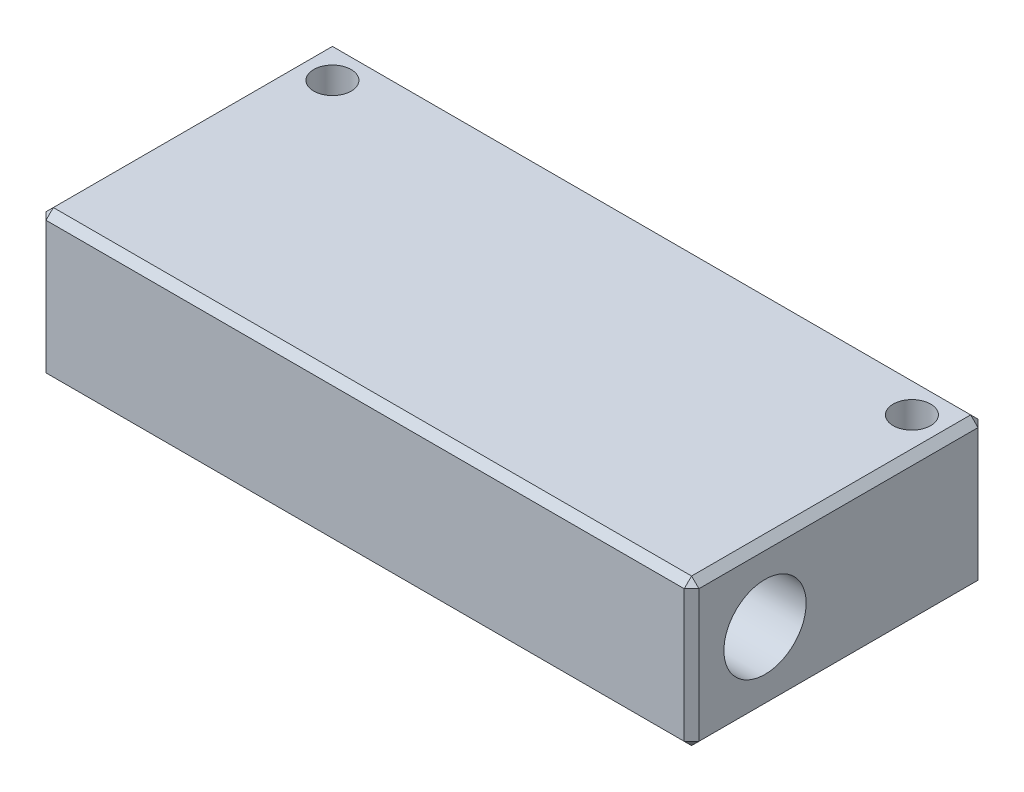
ISO-10303-21;
HEADER;
FILE_DESCRIPTION(('STEP AP214'),'2;1');
FILE_NAME('part.step','',(''),(''),'','','');
FILE_SCHEMA(('AUTOMOTIVE_DESIGN { 1 0 10303 214 1 1 1 1 }'));
ENDSEC;
DATA;
#1=APPLICATION_CONTEXT('core data for automotive mechanical design processes');
#2=APPLICATION_PROTOCOL_DEFINITION('international standard','automotive_design',2000,#1);
#3=PRODUCT_CONTEXT('',#1,'mechanical');
#4=PRODUCT('Part','Part','',(#3));
#5=PRODUCT_RELATED_PRODUCT_CATEGORY('part','',(#4));
#6=PRODUCT_DEFINITION_FORMATION('','',#4);
#7=PRODUCT_DEFINITION_CONTEXT('part definition',#1,'design');
#8=PRODUCT_DEFINITION('design','',#6,#7);
#9=PRODUCT_DEFINITION_SHAPE('','',#8);
#10=(LENGTH_UNIT() NAMED_UNIT(*) SI_UNIT(.MILLI.,.METRE.));
#11=(NAMED_UNIT(*) PLANE_ANGLE_UNIT() SI_UNIT($,.RADIAN.));
#12=(NAMED_UNIT(*) SI_UNIT($,.STERADIAN.) SOLID_ANGLE_UNIT());
#13=UNCERTAINTY_MEASURE_WITH_UNIT(LENGTH_MEASURE(1.E-05),#10,'distance_accuracy_value','');
#14=(GEOMETRIC_REPRESENTATION_CONTEXT(3) GLOBAL_UNCERTAINTY_ASSIGNED_CONTEXT((#13)) GLOBAL_UNIT_ASSIGNED_CONTEXT((#10,
#11,#12)) REPRESENTATION_CONTEXT('',''));
#15=CARTESIAN_POINT('',(0.,0.,0.));
#16=DIRECTION('',(0.,0.,1.));
#17=DIRECTION('',(1.,0.,0.));
#18=AXIS2_PLACEMENT_3D('',#15,#16,#17);
#19=CARTESIAN_POINT('',(-44.45,10.,9.99999999999999));
#20=DIRECTION('',(1.,0.,0.));
#21=DIRECTION('',(0.,0.,-1.));
#22=AXIS2_PLACEMENT_3D('',#19,#20,#21);
#23=CYLINDRICAL_SURFACE('',#22,5.);
#24=CARTESIAN_POINT('',(34.45,10.,9.99999999999999));
#25=DIRECTION('',(1.,0.,0.));
#26=DIRECTION('',(0.,0.,-1.));
#27=AXIS2_PLACEMENT_3D('',#24,#25,#26);
#28=CIRCLE('',#27,5.);
#29=CARTESIAN_POINT('',(34.45,10.,4.99999999999998));
#30=VERTEX_POINT('',#29);
#31=EDGE_CURVE('E159',#30,#30,#28,.F.);
#32=ORIENTED_EDGE('',*,*,#31,.F.);
#33=EDGE_LOOP('',(#32));
#34=FACE_BOUND('',#33,.T.);
#35=CARTESIAN_POINT('',(-34.45,10.,9.99999999999999));
#36=DIRECTION('',(-1.,0.,0.));
#37=DIRECTION('',(0.,0.,1.));
#38=AXIS2_PLACEMENT_3D('',#35,#36,#37);
#39=CIRCLE('',#38,5.);
#40=CARTESIAN_POINT('',(-34.45,10.,15.));
#41=VERTEX_POINT('',#40);
#42=EDGE_CURVE('E165',#41,#41,#39,.F.);
#43=ORIENTED_EDGE('',*,*,#42,.F.);
#44=EDGE_LOOP('',(#43));
#45=FACE_BOUND('',#44,.T.);
#46=ADVANCED_FACE('F35',(#34,#45),#23,.F.);
#47=CARTESIAN_POINT('',(44.45,20.,20.));
#48=DIRECTION('',(-1.,0.,0.));
#49=DIRECTION('',(0.,0.,1.));
#50=AXIS2_PLACEMENT_3D('',#47,#48,#49);
#51=PLANE('',#50);
#52=DIRECTION('',(0.,0.,1.));
#53=VECTOR('',#52,1.);
#54=CARTESIAN_POINT('',(44.45,19.,20.));
#55=LINE('',#54,#53);
#56=CARTESIAN_POINT('',(44.45,19.,-19.));
#57=VERTEX_POINT('',#56);
#58=CARTESIAN_POINT('',(44.45,19.,19.));
#59=VERTEX_POINT('',#58);
#60=EDGE_CURVE('E185',#57,#59,#55,.T.);
#61=ORIENTED_EDGE('',*,*,#60,.T.);
#62=DIRECTION('',(0.,-1.,0.));
#63=VECTOR('',#62,1.);
#64=CARTESIAN_POINT('',(44.45,20.,19.));
#65=LINE('',#64,#63);
#66=CARTESIAN_POINT('',(44.45,1.00000000000001,19.));
#67=VERTEX_POINT('',#66);
#68=EDGE_CURVE('E191',#59,#67,#65,.T.);
#69=ORIENTED_EDGE('',*,*,#68,.T.);
#70=DIRECTION('',(0.,0.,-1.));
#71=VECTOR('',#70,1.);
#72=CARTESIAN_POINT('',(44.45,1.00000000000001,-20.));
#73=LINE('',#72,#71);
#74=CARTESIAN_POINT('',(44.45,1.00000000000001,-19.));
#75=VERTEX_POINT('',#74);
#76=EDGE_CURVE('E189',#67,#75,#73,.T.);
#77=ORIENTED_EDGE('',*,*,#76,.T.);
#78=DIRECTION('',(0.,1.,0.));
#79=VECTOR('',#78,1.);
#80=CARTESIAN_POINT('',(44.45,20.,-19.));
#81=LINE('',#80,#79);
#82=EDGE_CURVE('E187',#75,#57,#81,.T.);
#83=ORIENTED_EDGE('',*,*,#82,.T.);
#84=EDGE_LOOP('',(#61,#69,#77,#83));
#85=FACE_BOUND('',#84,.T.);
#86=CARTESIAN_POINT('',(44.45,10.,9.99999999999999));
#87=DIRECTION('',(1.,0.,0.));
#88=DIRECTION('',(0.,0.,-1.));
#89=AXIS2_PLACEMENT_3D('',#86,#87,#88);
#90=CIRCLE('',#89,5.6);
#91=CARTESIAN_POINT('',(44.45,10.,4.39999999999999));
#92=VERTEX_POINT('',#91);
#93=EDGE_CURVE('E300',#92,#92,#90,.T.);
#94=ORIENTED_EDGE('',*,*,#93,.F.);
#95=EDGE_LOOP('',(#94));
#96=FACE_BOUND('',#95,.T.);
#97=ADVANCED_FACE('F310',(#85,#96),#51,.F.);
#98=CARTESIAN_POINT('',(-44.45,20.,-20.));
#99=DIRECTION('',(0.,0.,1.));
#100=DIRECTION('',(1.,0.,0.));
#101=AXIS2_PLACEMENT_3D('',#98,#99,#100);
#102=PLANE('',#101);
#103=DIRECTION('',(-1.,0.,0.));
#104=VECTOR('',#103,1.);
#105=CARTESIAN_POINT('',(-44.45,1.00000000000003,-20.));
#106=LINE('',#105,#104);
#107=CARTESIAN_POINT('',(43.45,1.00000000000003,-20.));
#108=VERTEX_POINT('',#107);
#109=CARTESIAN_POINT('',(-43.45,1.00000000000003,-20.));
#110=VERTEX_POINT('',#109);
#111=EDGE_CURVE('E173',#108,#110,#106,.T.);
#112=ORIENTED_EDGE('',*,*,#111,.T.);
#113=DIRECTION('',(0.,1.,0.));
#114=VECTOR('',#113,1.);
#115=CARTESIAN_POINT('',(-43.45,20.,-20.));
#116=LINE('',#115,#114);
#117=CARTESIAN_POINT('',(-43.45,19.,-20.));
#118=VERTEX_POINT('',#117);
#119=EDGE_CURVE('E175',#110,#118,#116,.T.);
#120=ORIENTED_EDGE('',*,*,#119,.T.);
#121=DIRECTION('',(1.,0.,0.));
#122=VECTOR('',#121,1.);
#123=CARTESIAN_POINT('',(-44.45,19.,-20.));
#124=LINE('',#123,#122);
#125=CARTESIAN_POINT('',(43.45,19.,-20.));
#126=VERTEX_POINT('',#125);
#127=EDGE_CURVE('E169',#118,#126,#124,.T.);
#128=ORIENTED_EDGE('',*,*,#127,.T.);
#129=DIRECTION('',(0.,-1.,0.));
#130=VECTOR('',#129,1.);
#131=CARTESIAN_POINT('',(43.45,20.,-20.));
#132=LINE('',#131,#130);
#133=EDGE_CURVE('E171',#126,#108,#132,.T.);
#134=ORIENTED_EDGE('',*,*,#133,.T.);
#135=EDGE_LOOP('',(#112,#120,#128,#134));
#136=FACE_BOUND('',#135,.T.);
#137=CARTESIAN_POINT('',(-22.5,10.,-20.));
#138=DIRECTION('',(0.,0.,-1.));
#139=DIRECTION('',(-1.,0.,0.));
#140=AXIS2_PLACEMENT_3D('',#137,#138,#139);
#141=CIRCLE('',#140,4.);
#142=CARTESIAN_POINT('',(-26.5,10.,-20.));
#143=VERTEX_POINT('',#142);
#144=EDGE_CURVE('E280',#143,#143,#141,.T.);
#145=ORIENTED_EDGE('',*,*,#144,.F.);
#146=EDGE_LOOP('',(#145));
#147=FACE_BOUND('',#146,.T.);
#148=CARTESIAN_POINT('',(22.5,10.,-20.));
#149=DIRECTION('',(0.,0.,-1.));
#150=DIRECTION('',(-1.,0.,0.));
#151=AXIS2_PLACEMENT_3D('',#148,#149,#150);
#152=CIRCLE('',#151,4.);
#153=CARTESIAN_POINT('',(18.5,10.,-20.));
#154=VERTEX_POINT('',#153);
#155=EDGE_CURVE('E284',#154,#154,#152,.T.);
#156=ORIENTED_EDGE('',*,*,#155,.F.);
#157=EDGE_LOOP('',(#156));
#158=FACE_BOUND('',#157,.T.);
#159=ADVANCED_FACE('F316',(#136,#147,#158),#102,.F.);
#160=CARTESIAN_POINT('',(-44.45,20.,20.));
#161=DIRECTION('',(1.,0.,0.));
#162=DIRECTION('',(0.,0.,-1.));
#163=AXIS2_PLACEMENT_3D('',#160,#161,#162);
#164=PLANE('',#163);
#165=DIRECTION('',(0.,-1.,0.));
#166=VECTOR('',#165,1.);
#167=CARTESIAN_POINT('',(-44.45,20.,-19.));
#168=LINE('',#167,#166);
#169=CARTESIAN_POINT('',(-44.45,19.,-19.));
#170=VERTEX_POINT('',#169);
#171=CARTESIAN_POINT('',(-44.45,1.00000000000001,-19.));
#172=VERTEX_POINT('',#171);
#173=EDGE_CURVE('E138',#170,#172,#168,.T.);
#174=ORIENTED_EDGE('',*,*,#173,.T.);
#175=DIRECTION('',(0.,0.,1.));
#176=VECTOR('',#175,1.);
#177=CARTESIAN_POINT('',(-44.45,1.00000000000001,20.));
#178=LINE('',#177,#176);
#179=CARTESIAN_POINT('',(-44.45,1.00000000000001,19.));
#180=VERTEX_POINT('',#179);
#181=EDGE_CURVE('E134',#172,#180,#178,.T.);
#182=ORIENTED_EDGE('',*,*,#181,.T.);
#183=DIRECTION('',(0.,1.,0.));
#184=VECTOR('',#183,1.);
#185=CARTESIAN_POINT('',(-44.45,20.,19.));
#186=LINE('',#185,#184);
#187=CARTESIAN_POINT('',(-44.45,19.,19.));
#188=VERTEX_POINT('',#187);
#189=EDGE_CURVE('E126',#180,#188,#186,.T.);
#190=ORIENTED_EDGE('',*,*,#189,.T.);
#191=DIRECTION('',(0.,0.,-1.));
#192=VECTOR('',#191,1.);
#193=CARTESIAN_POINT('',(-44.45,19.,20.));
#194=LINE('',#193,#192);
#195=EDGE_CURVE('E131',#188,#170,#194,.T.);
#196=ORIENTED_EDGE('',*,*,#195,.T.);
#197=EDGE_LOOP('',(#174,#182,#190,#196));
#198=FACE_BOUND('',#197,.T.);
#199=CARTESIAN_POINT('',(-44.45,10.,9.99999999999999));
#200=DIRECTION('',(1.,0.,0.));
#201=DIRECTION('',(0.,0.,-1.));
#202=AXIS2_PLACEMENT_3D('',#199,#200,#201);
#203=CIRCLE('',#202,5.6);
#204=CARTESIAN_POINT('',(-44.45,10.,4.39999999999999));
#205=VERTEX_POINT('',#204);
#206=EDGE_CURVE('E290',#205,#205,#203,.T.);
#207=ORIENTED_EDGE('',*,*,#206,.T.);
#208=EDGE_LOOP('',(#207));
#209=FACE_BOUND('',#208,.T.);
#210=ADVANCED_FACE('F129',(#198,#209),#164,.F.);
#211=CARTESIAN_POINT('',(-44.45,20.,20.));
#212=DIRECTION('',(0.,0.,-1.));
#213=DIRECTION('',(-1.,0.,0.));
#214=AXIS2_PLACEMENT_3D('',#211,#212,#213);
#215=PLANE('',#214);
#216=DIRECTION('',(0.,-1.,0.));
#217=VECTOR('',#216,1.);
#218=CARTESIAN_POINT('',(-43.45,20.,20.));
#219=LINE('',#218,#217);
#220=CARTESIAN_POINT('',(-43.45,19.,20.));
#221=VERTEX_POINT('',#220);
#222=CARTESIAN_POINT('',(-43.45,1.00000000000001,20.));
#223=VERTEX_POINT('',#222);
#224=EDGE_CURVE('E145',#221,#223,#219,.T.);
#225=ORIENTED_EDGE('',*,*,#224,.T.);
#226=DIRECTION('',(1.,0.,0.));
#227=VECTOR('',#226,1.);
#228=CARTESIAN_POINT('',(44.45,1.00000000000001,20.));
#229=LINE('',#228,#227);
#230=CARTESIAN_POINT('',(43.45,1.00000000000001,20.));
#231=VERTEX_POINT('',#230);
#232=EDGE_CURVE('E183',#223,#231,#229,.T.);
#233=ORIENTED_EDGE('',*,*,#232,.T.);
#234=DIRECTION('',(0.,1.,0.));
#235=VECTOR('',#234,1.);
#236=CARTESIAN_POINT('',(43.45,20.,20.));
#237=LINE('',#236,#235);
#238=CARTESIAN_POINT('',(43.45,19.,20.));
#239=VERTEX_POINT('',#238);
#240=EDGE_CURVE('E180',#231,#239,#237,.T.);
#241=ORIENTED_EDGE('',*,*,#240,.T.);
#242=DIRECTION('',(-1.,0.,0.));
#243=VECTOR('',#242,1.);
#244=CARTESIAN_POINT('',(-44.45,19.,20.));
#245=LINE('',#244,#243);
#246=EDGE_CURVE('E178',#239,#221,#245,.T.);
#247=ORIENTED_EDGE('',*,*,#246,.T.);
#248=EDGE_LOOP('',(#225,#233,#241,#247));
#249=FACE_BOUND('',#248,.T.);
#250=ADVANCED_FACE('F328',(#249),#215,.F.);
#251=CARTESIAN_POINT('',(0.,20.,0.));
#252=DIRECTION('',(0.,-1.,0.));
#253=DIRECTION('',(0.,0.,-1.));
#254=AXIS2_PLACEMENT_3D('',#251,#252,#253);
#255=PLANE('',#254);
#256=DIRECTION('',(-1.,0.,0.));
#257=VECTOR('',#256,1.);
#258=CARTESIAN_POINT('',(0.,20.,-19.));
#259=LINE('',#258,#257);
#260=CARTESIAN_POINT('',(43.45,20.,-19.));
#261=VERTEX_POINT('',#260);
#262=CARTESIAN_POINT('',(-43.45,20.,-19.));
#263=VERTEX_POINT('',#262);
#264=EDGE_CURVE('E203',#261,#263,#259,.T.);
#265=ORIENTED_EDGE('',*,*,#264,.T.);
#266=DIRECTION('',(0.,0.,1.));
#267=VECTOR('',#266,1.);
#268=CARTESIAN_POINT('',(-43.45,20.,0.));
#269=LINE('',#268,#267);
#270=CARTESIAN_POINT('',(-43.45,20.,19.));
#271=VERTEX_POINT('',#270);
#272=EDGE_CURVE('E11',#263,#271,#269,.T.);
#273=ORIENTED_EDGE('',*,*,#272,.T.);
#274=DIRECTION('',(1.,0.,0.));
#275=VECTOR('',#274,1.);
#276=CARTESIAN_POINT('',(0.,20.,19.));
#277=LINE('',#276,#275);
#278=CARTESIAN_POINT('',(43.45,20.,19.));
#279=VERTEX_POINT('',#278);
#280=EDGE_CURVE('E44',#271,#279,#277,.T.);
#281=ORIENTED_EDGE('',*,*,#280,.T.);
#282=DIRECTION('',(0.,0.,-1.));
#283=VECTOR('',#282,1.);
#284=CARTESIAN_POINT('',(43.45,20.,0.));
#285=LINE('',#284,#283);
#286=EDGE_CURVE('E205',#279,#261,#285,.T.);
#287=ORIENTED_EDGE('',*,*,#286,.T.);
#288=EDGE_LOOP('',(#265,#273,#281,#287));
#289=FACE_BOUND('',#288,.T.);
#290=CARTESIAN_POINT('',(39.45,20.,-15.));
#291=DIRECTION('',(0.,1.,0.));
#292=DIRECTION('',(0.,0.,1.));
#293=AXIS2_PLACEMENT_3D('',#290,#291,#292);
#294=CIRCLE('',#293,2.55269999999998);
#295=CARTESIAN_POINT('',(39.45,20.,-12.4473));
#296=VERTEX_POINT('',#295);
#297=EDGE_CURVE('E261',#296,#296,#294,.T.);
#298=ORIENTED_EDGE('',*,*,#297,.F.);
#299=EDGE_LOOP('',(#298));
#300=FACE_BOUND('',#299,.T.);
#301=CARTESIAN_POINT('',(-39.45,20.,-15.));
#302=DIRECTION('',(0.,1.,0.));
#303=DIRECTION('',(0.,0.,1.));
#304=AXIS2_PLACEMENT_3D('',#301,#302,#303);
#305=CIRCLE('',#304,2.55269999999999);
#306=CARTESIAN_POINT('',(-39.45,20.,-12.4473));
#307=VERTEX_POINT('',#306);
#308=EDGE_CURVE('E272',#307,#307,#305,.T.);
#309=ORIENTED_EDGE('',*,*,#308,.F.);
#310=EDGE_LOOP('',(#309));
#311=FACE_BOUND('',#310,.T.);
#312=ADVANCED_FACE('F324',(#289,#300,#311),#255,.F.);
#313=CARTESIAN_POINT('',(0.,0.,0.));
#314=DIRECTION('',(0.,-1.,0.));
#315=DIRECTION('',(0.,0.,-1.));
#316=AXIS2_PLACEMENT_3D('',#313,#314,#315);
#317=PLANE('',#316);
#318=DIRECTION('',(0.,0.,-1.));
#319=VECTOR('',#318,1.);
#320=CARTESIAN_POINT('',(-43.45,0.,-20.));
#321=LINE('',#320,#319);
#322=CARTESIAN_POINT('',(-43.45,0.,19.));
#323=VERTEX_POINT('',#322);
#324=CARTESIAN_POINT('',(-43.45,0.,-19.));
#325=VERTEX_POINT('',#324);
#326=EDGE_CURVE('E198',#323,#325,#321,.T.);
#327=ORIENTED_EDGE('',*,*,#326,.T.);
#328=DIRECTION('',(1.,0.,0.));
#329=VECTOR('',#328,1.);
#330=CARTESIAN_POINT('',(44.45,0.,-19.));
#331=LINE('',#330,#329);
#332=CARTESIAN_POINT('',(43.45,0.,-19.));
#333=VERTEX_POINT('',#332);
#334=EDGE_CURVE('E200',#325,#333,#331,.T.);
#335=ORIENTED_EDGE('',*,*,#334,.T.);
#336=DIRECTION('',(0.,0.,1.));
#337=VECTOR('',#336,1.);
#338=CARTESIAN_POINT('',(43.45,0.,20.));
#339=LINE('',#338,#337);
#340=CARTESIAN_POINT('',(43.45,0.,19.));
#341=VERTEX_POINT('',#340);
#342=EDGE_CURVE('E194',#333,#341,#339,.T.);
#343=ORIENTED_EDGE('',*,*,#342,.T.);
#344=DIRECTION('',(-1.,0.,0.));
#345=VECTOR('',#344,1.);
#346=CARTESIAN_POINT('',(-44.45,0.,19.));
#347=LINE('',#346,#345);
#348=EDGE_CURVE('E196',#341,#323,#347,.T.);
#349=ORIENTED_EDGE('',*,*,#348,.T.);
#350=EDGE_LOOP('',(#327,#335,#343,#349));
#351=FACE_BOUND('',#350,.T.);
#352=CARTESIAN_POINT('',(39.45,0.,-15.));
#353=DIRECTION('',(0.,1.,0.));
#354=DIRECTION('',(0.,0.,1.));
#355=AXIS2_PLACEMENT_3D('',#352,#353,#354);
#356=CIRCLE('',#355,2.5527);
#357=CARTESIAN_POINT('',(39.45,0.,-12.4473));
#358=VERTEX_POINT('',#357);
#359=EDGE_CURVE('E267',#358,#358,#356,.T.);
#360=ORIENTED_EDGE('',*,*,#359,.T.);
#361=EDGE_LOOP('',(#360));
#362=FACE_BOUND('',#361,.T.);
#363=CARTESIAN_POINT('',(-39.45,0.,-15.));
#364=DIRECTION('',(0.,1.,0.));
#365=DIRECTION('',(0.,0.,1.));
#366=AXIS2_PLACEMENT_3D('',#363,#364,#365);
#367=CIRCLE('',#366,2.5527);
#368=CARTESIAN_POINT('',(-39.45,0.,-12.4473));
#369=VERTEX_POINT('',#368);
#370=EDGE_CURVE('E277',#369,#369,#367,.T.);
#371=ORIENTED_EDGE('',*,*,#370,.T.);
#372=EDGE_LOOP('',(#371));
#373=FACE_BOUND('',#372,.T.);
#374=ADVANCED_FACE('F327',(#351,#362,#373),#317,.T.);
#375=CARTESIAN_POINT('',(34.45,10.,9.99999999999999));
#376=DIRECTION('',(1.,0.,0.));
#377=DIRECTION('',(0.,0.,-1.));
#378=AXIS2_PLACEMENT_3D('',#375,#376,#377);
#379=PLANE('',#378);
#380=CARTESIAN_POINT('',(34.45,10.,9.99999999999999));
#381=DIRECTION('',(1.,0.,0.));
#382=DIRECTION('',(0.,0.,-1.));
#383=AXIS2_PLACEMENT_3D('',#380,#381,#382);
#384=CIRCLE('',#383,5.6);
#385=CARTESIAN_POINT('',(34.45,10.,4.39999999999999));
#386=VERTEX_POINT('',#385);
#387=EDGE_CURVE('E162',#386,#386,#384,.T.);
#388=ORIENTED_EDGE('',*,*,#387,.T.);
#389=EDGE_LOOP('',(#388));
#390=FACE_BOUND('',#389,.T.);
#391=ORIENTED_EDGE('',*,*,#31,.T.);
#392=EDGE_LOOP('',(#391));
#393=FACE_BOUND('',#392,.T.);
#394=ADVANCED_FACE('F331',(#390,#393),#379,.T.);
#395=CARTESIAN_POINT('',(34.45,10.,9.99999999999999));
#396=DIRECTION('',(1.,0.,0.));
#397=DIRECTION('',(0.,0.,-1.));
#398=AXIS2_PLACEMENT_3D('',#395,#396,#397);
#399=CYLINDRICAL_SURFACE('',#398,5.6);
#400=ORIENTED_EDGE('',*,*,#387,.F.);
#401=EDGE_LOOP('',(#400));
#402=FACE_BOUND('',#401,.T.);
#403=ORIENTED_EDGE('',*,*,#93,.T.);
#404=EDGE_LOOP('',(#403));
#405=FACE_BOUND('',#404,.T.);
#406=ADVANCED_FACE('F322',(#402,#405),#399,.F.);
#407=CARTESIAN_POINT('',(-34.45,10.,9.99999999999999));
#408=DIRECTION('',(-1.,0.,0.));
#409=DIRECTION('',(0.,0.,-1.));
#410=AXIS2_PLACEMENT_3D('',#407,#408,#409);
#411=PLANE('',#410);
#412=CARTESIAN_POINT('',(-34.45,10.,9.99999999999999));
#413=DIRECTION('',(1.,0.,0.));
#414=DIRECTION('',(0.,0.,-1.));
#415=AXIS2_PLACEMENT_3D('',#412,#413,#414);
#416=CIRCLE('',#415,5.6);
#417=CARTESIAN_POINT('',(-34.45,10.,4.39999999999999));
#418=VERTEX_POINT('',#417);
#419=EDGE_CURVE('E293',#418,#418,#416,.T.);
#420=ORIENTED_EDGE('',*,*,#419,.F.);
#421=EDGE_LOOP('',(#420));
#422=FACE_BOUND('',#421,.T.);
#423=ORIENTED_EDGE('',*,*,#42,.T.);
#424=EDGE_LOOP('',(#423));
#425=FACE_BOUND('',#424,.T.);
#426=ADVANCED_FACE('F307',(#422,#425),#411,.T.);
#427=CARTESIAN_POINT('',(-34.45,10.,9.99999999999999));
#428=DIRECTION('',(-1.,0.,0.));
#429=DIRECTION('',(0.,0.,1.));
#430=AXIS2_PLACEMENT_3D('',#427,#428,#429);
#431=CYLINDRICAL_SURFACE('',#430,5.6);
#432=ORIENTED_EDGE('',*,*,#419,.T.);
#433=EDGE_LOOP('',(#432));
#434=FACE_BOUND('',#433,.T.);
#435=ORIENTED_EDGE('',*,*,#206,.F.);
#436=EDGE_LOOP('',(#435));
#437=FACE_BOUND('',#436,.T.);
#438=ADVANCED_FACE('F459',(#434,#437),#431,.F.);
#439=CARTESIAN_POINT('',(22.5,10.,-10.));
#440=DIRECTION('',(0.,0.,-1.));
#441=DIRECTION('',(-1.,0.,0.));
#442=AXIS2_PLACEMENT_3D('',#439,#440,#441);
#443=CYLINDRICAL_SURFACE('',#442,4.);
#444=CARTESIAN_POINT('',(22.5,10.,-10.));
#445=DIRECTION('',(0.,0.,-1.));
#446=DIRECTION('',(-1.,0.,0.));
#447=AXIS2_PLACEMENT_3D('',#444,#445,#446);
#448=CIRCLE('',#447,4.);
#449=CARTESIAN_POINT('',(18.5,10.,-10.));
#450=VERTEX_POINT('',#449);
#451=EDGE_CURVE('E287',#450,#450,#448,.T.);
#452=ORIENTED_EDGE('',*,*,#451,.F.);
#453=EDGE_LOOP('',(#452));
#454=FACE_BOUND('',#453,.T.);
#455=ORIENTED_EDGE('',*,*,#155,.T.);
#456=EDGE_LOOP('',(#455));
#457=FACE_BOUND('',#456,.T.);
#458=ADVANCED_FACE('F455',(#454,#457),#443,.F.);
#459=CARTESIAN_POINT('',(22.5,10.,-10.));
#460=DIRECTION('',(0.,0.,-1.));
#461=DIRECTION('',(-1.,0.,0.));
#462=AXIS2_PLACEMENT_3D('',#459,#460,#461);
#463=PLANE('',#462);
#464=ORIENTED_EDGE('',*,*,#451,.T.);
#465=EDGE_LOOP('',(#464));
#466=FACE_BOUND('',#465,.T.);
#467=ADVANCED_FACE('F451',(#466),#463,.T.);
#468=CARTESIAN_POINT('',(-22.5,10.,-10.));
#469=DIRECTION('',(0.,0.,-1.));
#470=DIRECTION('',(-1.,0.,0.));
#471=AXIS2_PLACEMENT_3D('',#468,#469,#470);
#472=CYLINDRICAL_SURFACE('',#471,4.);
#473=CARTESIAN_POINT('',(-22.5,10.,-10.));
#474=DIRECTION('',(0.,0.,-1.));
#475=DIRECTION('',(-1.,0.,0.));
#476=AXIS2_PLACEMENT_3D('',#473,#474,#475);
#477=CIRCLE('',#476,4.);
#478=CARTESIAN_POINT('',(-26.5,10.,-10.));
#479=VERTEX_POINT('',#478);
#480=EDGE_CURVE('E281',#479,#479,#477,.T.);
#481=ORIENTED_EDGE('',*,*,#480,.F.);
#482=EDGE_LOOP('',(#481));
#483=FACE_BOUND('',#482,.T.);
#484=ORIENTED_EDGE('',*,*,#144,.T.);
#485=EDGE_LOOP('',(#484));
#486=FACE_BOUND('',#485,.T.);
#487=ADVANCED_FACE('F444',(#483,#486),#472,.F.);
#488=CARTESIAN_POINT('',(-22.5,10.,-10.));
#489=DIRECTION('',(0.,0.,-1.));
#490=DIRECTION('',(-1.,0.,0.));
#491=AXIS2_PLACEMENT_3D('',#488,#489,#490);
#492=PLANE('',#491);
#493=ORIENTED_EDGE('',*,*,#480,.T.);
#494=EDGE_LOOP('',(#493));
#495=FACE_BOUND('',#494,.T.);
#496=ADVANCED_FACE('F435',(#495),#492,.T.);
#497=CARTESIAN_POINT('',(-39.45,20.,-15.));
#498=DIRECTION('',(0.,1.,0.));
#499=DIRECTION('',(0.,0.,1.));
#500=AXIS2_PLACEMENT_3D('',#497,#498,#499);
#501=CYLINDRICAL_SURFACE('',#500,2.55269999999999);
#502=ORIENTED_EDGE('',*,*,#370,.F.);
#503=EDGE_LOOP('',(#502));
#504=FACE_BOUND('',#503,.T.);
#505=ORIENTED_EDGE('',*,*,#308,.T.);
#506=EDGE_LOOP('',(#505));
#507=FACE_BOUND('',#506,.T.);
#508=ADVANCED_FACE('F433',(#504,#507),#501,.F.);
#509=CARTESIAN_POINT('',(39.45,20.,-15.));
#510=DIRECTION('',(0.,1.,0.));
#511=DIRECTION('',(0.,0.,1.));
#512=AXIS2_PLACEMENT_3D('',#509,#510,#511);
#513=CYLINDRICAL_SURFACE('',#512,2.55269999999999);
#514=ORIENTED_EDGE('',*,*,#359,.F.);
#515=EDGE_LOOP('',(#514));
#516=FACE_BOUND('',#515,.T.);
#517=ORIENTED_EDGE('',*,*,#297,.T.);
#518=EDGE_LOOP('',(#517));
#519=FACE_BOUND('',#518,.T.);
#520=ADVANCED_FACE('F410',(#516,#519),#513,.F.);
#521=CARTESIAN_POINT('',(44.45,20.,19.));
#522=DIRECTION('',(-0.707106781186543,0.,-0.707106781186552));
#523=DIRECTION('',(0.,-1.,0.));
#524=AXIS2_PLACEMENT_3D('',#521,#522,#523);
#525=PLANE('',#524);
#526=DIRECTION('',(-0.707106781186552,0.,0.707106781186543));
#527=VECTOR('',#526,1.);
#528=CARTESIAN_POINT('',(43.45,19.,20.));
#529=LINE('',#528,#527);
#530=EDGE_CURVE('E39',#239,#59,#529,.F.);
#531=ORIENTED_EDGE('',*,*,#530,.F.);
#532=ORIENTED_EDGE('',*,*,#240,.F.);
#533=DIRECTION('',(0.707106781186552,0.,-0.707106781186543));
#534=VECTOR('',#533,1.);
#535=CARTESIAN_POINT('',(44.45,1.00000000000001,19.));
#536=LINE('',#535,#534);
#537=EDGE_CURVE('E254',#67,#231,#536,.F.);
#538=ORIENTED_EDGE('',*,*,#537,.F.);
#539=ORIENTED_EDGE('',*,*,#68,.F.);
#540=EDGE_LOOP('',(#531,#532,#538,#539));
#541=FACE_BOUND('',#540,.T.);
#542=ADVANCED_FACE('F37',(#541),#525,.F.);
#543=CARTESIAN_POINT('',(43.45,19.,20.));
#544=DIRECTION('',(0.577350269189626,0.577350269189618,0.577350269189634));
#545=DIRECTION('',(0.707106781186552,0.,-0.707106781186543));
#546=AXIS2_PLACEMENT_3D('',#543,#544,#545);
#547=PLANE('',#546);
#548=DIRECTION('',(0.,0.707106781186552,-0.707106781186543));
#549=VECTOR('',#548,1.);
#550=CARTESIAN_POINT('',(43.45,19.,20.));
#551=LINE('',#550,#549);
#552=EDGE_CURVE('E250',#239,#279,#551,.T.);
#553=ORIENTED_EDGE('',*,*,#552,.F.);
#554=ORIENTED_EDGE('',*,*,#530,.T.);
#555=DIRECTION('',(0.707106781186543,-0.707106781186552,0.));
#556=VECTOR('',#555,1.);
#557=CARTESIAN_POINT('',(43.95,19.5,19.));
#558=LINE('',#557,#556);
#559=EDGE_CURVE('E252',#279,#59,#558,.T.);
#560=ORIENTED_EDGE('',*,*,#559,.F.);
#561=EDGE_LOOP('',(#553,#554,#560));
#562=FACE_BOUND('',#561,.T.);
#563=ADVANCED_FACE('F405',(#562),#547,.T.);
#564=CARTESIAN_POINT('',(44.45,1.00000000000001,19.));
#565=DIRECTION('',(0.577350269189618,-0.577350269189634,0.577350269189626));
#566=DIRECTION('',(0.,-0.707106781186543,-0.707106781186553));
#567=AXIS2_PLACEMENT_3D('',#564,#565,#566);
#568=PLANE('',#567);
#569=DIRECTION('',(0.707106781186552,0.707106781186543,0.));
#570=VECTOR('',#569,1.);
#571=CARTESIAN_POINT('',(44.45,1.00000000000001,19.));
#572=LINE('',#571,#570);
#573=EDGE_CURVE('E244',#67,#341,#572,.F.);
#574=ORIENTED_EDGE('',*,*,#573,.F.);
#575=ORIENTED_EDGE('',*,*,#537,.T.);
#576=DIRECTION('',(0.,-0.707106781186543,-0.707106781186552));
#577=VECTOR('',#576,1.);
#578=CARTESIAN_POINT('',(43.45,0.500000000000007,19.5));
#579=LINE('',#578,#577);
#580=EDGE_CURVE('E247',#341,#231,#579,.F.);
#581=ORIENTED_EDGE('',*,*,#580,.F.);
#582=EDGE_LOOP('',(#574,#575,#581));
#583=FACE_BOUND('',#582,.T.);
#584=ADVANCED_FACE('F402',(#583),#568,.T.);
#585=CARTESIAN_POINT('',(43.45,20.,0.));
#586=DIRECTION('',(-0.707106781186552,-0.707106781186543,0.));
#587=DIRECTION('',(0.,0.,-1.));
#588=AXIS2_PLACEMENT_3D('',#585,#586,#587);
#589=PLANE('',#588);
#590=ORIENTED_EDGE('',*,*,#559,.T.);
#591=ORIENTED_EDGE('',*,*,#60,.F.);
#592=DIRECTION('',(-0.707106781186543,0.707106781186552,0.));
#593=VECTOR('',#592,1.);
#594=CARTESIAN_POINT('',(44.45,19.,-19.));
#595=LINE('',#594,#593);
#596=EDGE_CURVE('E238',#261,#57,#595,.F.);
#597=ORIENTED_EDGE('',*,*,#596,.F.);
#598=ORIENTED_EDGE('',*,*,#286,.F.);
#599=EDGE_LOOP('',(#590,#591,#597,#598));
#600=FACE_BOUND('',#599,.T.);
#601=ADVANCED_FACE('F398',(#600),#589,.F.);
#602=CARTESIAN_POINT('',(0.,20.,19.));
#603=DIRECTION('',(0.,-0.707106781186543,-0.707106781186552));
#604=DIRECTION('',(1.,0.,0.));
#605=AXIS2_PLACEMENT_3D('',#602,#603,#604);
#606=PLANE('',#605);
#607=ORIENTED_EDGE('',*,*,#552,.T.);
#608=ORIENTED_EDGE('',*,*,#280,.F.);
#609=DIRECTION('',(0.,-0.707106781186552,0.707106781186543));
#610=VECTOR('',#609,1.);
#611=CARTESIAN_POINT('',(-43.45,19.5,19.5));
#612=LINE('',#611,#610);
#613=EDGE_CURVE('E148',#221,#271,#612,.F.);
#614=ORIENTED_EDGE('',*,*,#613,.F.);
#615=ORIENTED_EDGE('',*,*,#246,.F.);
#616=EDGE_LOOP('',(#607,#608,#614,#615));
#617=FACE_BOUND('',#616,.T.);
#618=ADVANCED_FACE('F395',(#617),#606,.F.);
#619=CARTESIAN_POINT('',(-43.45,20.,20.));
#620=DIRECTION('',(0.707106781186552,0.,-0.707106781186543));
#621=DIRECTION('',(0.,-1.,0.));
#622=AXIS2_PLACEMENT_3D('',#619,#620,#621);
#623=PLANE('',#622);
#624=DIRECTION('',(0.707106781186543,0.,0.707106781186552));
#625=VECTOR('',#624,1.);
#626=CARTESIAN_POINT('',(-43.45,1.00000000000001,20.));
#627=LINE('',#626,#625);
#628=EDGE_CURVE('E149',#223,#180,#627,.F.);
#629=ORIENTED_EDGE('',*,*,#628,.F.);
#630=ORIENTED_EDGE('',*,*,#224,.F.);
#631=DIRECTION('',(-0.707106781186543,0.,-0.707106781186552));
#632=VECTOR('',#631,1.);
#633=CARTESIAN_POINT('',(-44.45,19.,19.));
#634=LINE('',#633,#632);
#635=EDGE_CURVE('E142',#188,#221,#634,.F.);
#636=ORIENTED_EDGE('',*,*,#635,.F.);
#637=ORIENTED_EDGE('',*,*,#189,.F.);
#638=EDGE_LOOP('',(#629,#630,#636,#637));
#639=FACE_BOUND('',#638,.T.);
#640=ADVANCED_FACE('F143',(#639),#623,.F.);
#641=CARTESIAN_POINT('',(-44.45,1.00000000000001,20.));
#642=DIRECTION('',(0.,-0.707106781186552,0.707106781186543));
#643=DIRECTION('',(-1.,0.,0.));
#644=AXIS2_PLACEMENT_3D('',#641,#642,#643);
#645=PLANE('',#644);
#646=ORIENTED_EDGE('',*,*,#580,.T.);
#647=ORIENTED_EDGE('',*,*,#232,.F.);
#648=DIRECTION('',(0.,0.707106781186543,0.707106781186552));
#649=VECTOR('',#648,1.);
#650=CARTESIAN_POINT('',(-43.45,1.00000000000001,20.));
#651=LINE('',#650,#649);
#652=EDGE_CURVE('E234',#323,#223,#651,.T.);
#653=ORIENTED_EDGE('',*,*,#652,.F.);
#654=ORIENTED_EDGE('',*,*,#348,.F.);
#655=EDGE_LOOP('',(#646,#647,#653,#654));
#656=FACE_BOUND('',#655,.T.);
#657=ADVANCED_FACE('F388',(#656),#645,.T.);
#658=CARTESIAN_POINT('',(44.45,1.00000000000001,20.));
#659=DIRECTION('',(0.707106781186543,-0.707106781186552,0.));
#660=DIRECTION('',(0.,0.,1.));
#661=AXIS2_PLACEMENT_3D('',#658,#659,#660);
#662=PLANE('',#661);
#663=ORIENTED_EDGE('',*,*,#573,.T.);
#664=ORIENTED_EDGE('',*,*,#342,.F.);
#665=DIRECTION('',(-0.707106781186552,-0.707106781186543,0.));
#666=VECTOR('',#665,1.);
#667=CARTESIAN_POINT('',(43.45,0.,-19.));
#668=LINE('',#667,#666);
#669=EDGE_CURVE('E231',#75,#333,#668,.T.);
#670=ORIENTED_EDGE('',*,*,#669,.F.);
#671=ORIENTED_EDGE('',*,*,#76,.F.);
#672=EDGE_LOOP('',(#663,#664,#670,#671));
#673=FACE_BOUND('',#672,.T.);
#674=ADVANCED_FACE('F384',(#673),#662,.T.);
#675=CARTESIAN_POINT('',(43.45,20.,-20.));
#676=DIRECTION('',(-0.707106781186543,0.,0.707106781186552));
#677=DIRECTION('',(0.,-1.,0.));
#678=AXIS2_PLACEMENT_3D('',#675,#676,#677);
#679=PLANE('',#678);
#680=DIRECTION('',(0.707106781186552,0.,0.707106781186543));
#681=VECTOR('',#680,1.);
#682=CARTESIAN_POINT('',(44.45,19.,-19.));
#683=LINE('',#682,#681);
#684=EDGE_CURVE('E241',#57,#126,#683,.F.);
#685=ORIENTED_EDGE('',*,*,#684,.F.);
#686=ORIENTED_EDGE('',*,*,#82,.F.);
#687=DIRECTION('',(-0.707106781186552,0.,-0.707106781186543));
#688=VECTOR('',#687,1.);
#689=CARTESIAN_POINT('',(43.95,1.00000000000002,-19.5));
#690=LINE('',#689,#688);
#691=EDGE_CURVE('E228',#108,#75,#690,.F.);
#692=ORIENTED_EDGE('',*,*,#691,.F.);
#693=ORIENTED_EDGE('',*,*,#133,.F.);
#694=EDGE_LOOP('',(#685,#686,#692,#693));
#695=FACE_BOUND('',#694,.T.);
#696=ADVANCED_FACE('F380',(#695),#679,.F.);
#697=CARTESIAN_POINT('',(44.45,19.,-19.));
#698=DIRECTION('',(0.577350269189626,0.577350269189618,-0.577350269189634));
#699=DIRECTION('',(-0.707106781186552,0.,-0.707106781186543));
#700=AXIS2_PLACEMENT_3D('',#697,#698,#699);
#701=PLANE('',#700);
#702=ORIENTED_EDGE('',*,*,#596,.T.);
#703=ORIENTED_EDGE('',*,*,#684,.T.);
#704=DIRECTION('',(0.,-0.707106781186552,-0.707106781186543));
#705=VECTOR('',#704,1.);
#706=CARTESIAN_POINT('',(43.45,19.5,-19.5));
#707=LINE('',#706,#705);
#708=EDGE_CURVE('E152',#261,#126,#707,.T.);
#709=ORIENTED_EDGE('',*,*,#708,.F.);
#710=EDGE_LOOP('',(#702,#703,#709));
#711=FACE_BOUND('',#710,.T.);
#712=ADVANCED_FACE('F377',(#711),#701,.T.);
#713=CARTESIAN_POINT('',(-44.45,19.,19.));
#714=DIRECTION('',(-0.577350269189634,0.577350269189618,0.577350269189626));
#715=DIRECTION('',(0.707106781186543,0.,0.707106781186552));
#716=AXIS2_PLACEMENT_3D('',#713,#714,#715);
#717=PLANE('',#716);
#718=ORIENTED_EDGE('',*,*,#635,.T.);
#719=ORIENTED_EDGE('',*,*,#613,.T.);
#720=DIRECTION('',(0.707106781186543,0.707106781186552,0.));
#721=VECTOR('',#720,1.);
#722=CARTESIAN_POINT('',(-44.45,19.,19.));
#723=LINE('',#722,#721);
#724=EDGE_CURVE('E52',#188,#271,#723,.T.);
#725=ORIENTED_EDGE('',*,*,#724,.F.);
#726=EDGE_LOOP('',(#718,#719,#725));
#727=FACE_BOUND('',#726,.T.);
#728=ADVANCED_FACE('F151',(#727),#717,.T.);
#729=CARTESIAN_POINT('',(-43.45,1.00000000000001,20.));
#730=DIRECTION('',(-0.577350269189626,-0.577350269189634,0.577350269189618));
#731=DIRECTION('',(0.707106781186552,-0.707106781186543,0.));
#732=AXIS2_PLACEMENT_3D('',#729,#730,#731);
#733=PLANE('',#732);
#734=ORIENTED_EDGE('',*,*,#652,.T.);
#735=ORIENTED_EDGE('',*,*,#628,.T.);
#736=DIRECTION('',(0.707106781186552,-0.707106781186543,0.));
#737=VECTOR('',#736,1.);
#738=CARTESIAN_POINT('',(-43.95,0.500000000000007,19.));
#739=LINE('',#738,#737);
#740=EDGE_CURVE('E153',#323,#180,#739,.F.);
#741=ORIENTED_EDGE('',*,*,#740,.F.);
#742=EDGE_LOOP('',(#734,#735,#741));
#743=FACE_BOUND('',#742,.T.);
#744=ADVANCED_FACE('F370',(#743),#733,.T.);
#745=CARTESIAN_POINT('',(43.45,0.,-19.));
#746=DIRECTION('',(0.577350269189618,-0.577350269189626,-0.577350269189634));
#747=DIRECTION('',(0.,0.707106781186552,-0.707106781186543));
#748=AXIS2_PLACEMENT_3D('',#745,#746,#747);
#749=PLANE('',#748);
#750=ORIENTED_EDGE('',*,*,#691,.T.);
#751=ORIENTED_EDGE('',*,*,#669,.T.);
#752=DIRECTION('',(0.,0.707106781186552,-0.707106781186543));
#753=VECTOR('',#752,1.);
#754=CARTESIAN_POINT('',(43.45,0.,-19.));
#755=LINE('',#754,#753);
#756=EDGE_CURVE('E222',#108,#333,#755,.F.);
#757=ORIENTED_EDGE('',*,*,#756,.F.);
#758=EDGE_LOOP('',(#750,#751,#757));
#759=FACE_BOUND('',#758,.T.);
#760=ADVANCED_FACE('F366',(#759),#749,.T.);
#761=CARTESIAN_POINT('',(0.,20.,-19.));
#762=DIRECTION('',(0.,-0.707106781186543,0.707106781186552));
#763=DIRECTION('',(-1.,0.,0.));
#764=AXIS2_PLACEMENT_3D('',#761,#762,#763);
#765=PLANE('',#764);
#766=ORIENTED_EDGE('',*,*,#708,.T.);
#767=ORIENTED_EDGE('',*,*,#127,.F.);
#768=DIRECTION('',(0.,0.707106781186552,0.707106781186543));
#769=VECTOR('',#768,1.);
#770=CARTESIAN_POINT('',(-43.45,19.,-20.));
#771=LINE('',#770,#769);
#772=EDGE_CURVE('E219',#263,#118,#771,.F.);
#773=ORIENTED_EDGE('',*,*,#772,.F.);
#774=ORIENTED_EDGE('',*,*,#264,.F.);
#775=EDGE_LOOP('',(#766,#767,#773,#774));
#776=FACE_BOUND('',#775,.T.);
#777=ADVANCED_FACE('F363',(#776),#765,.F.);
#778=CARTESIAN_POINT('',(-43.45,20.,0.));
#779=DIRECTION('',(0.707106781186552,-0.707106781186543,0.));
#780=DIRECTION('',(0.,0.,1.));
#781=AXIS2_PLACEMENT_3D('',#778,#779,#780);
#782=PLANE('',#781);
#783=ORIENTED_EDGE('',*,*,#724,.T.);
#784=ORIENTED_EDGE('',*,*,#272,.F.);
#785=DIRECTION('',(-0.707106781186543,-0.707106781186552,0.));
#786=VECTOR('',#785,1.);
#787=CARTESIAN_POINT('',(-43.95,19.5,-19.));
#788=LINE('',#787,#786);
#789=EDGE_CURVE('E157',#170,#263,#788,.F.);
#790=ORIENTED_EDGE('',*,*,#789,.F.);
#791=ORIENTED_EDGE('',*,*,#195,.F.);
#792=EDGE_LOOP('',(#783,#784,#790,#791));
#793=FACE_BOUND('',#792,.T.);
#794=ADVANCED_FACE('F155',(#793),#782,.F.);
#795=CARTESIAN_POINT('',(-44.45,1.00000000000001,20.));
#796=DIRECTION('',(-0.707106781186543,-0.707106781186552,0.));
#797=DIRECTION('',(0.,0.,-1.));
#798=AXIS2_PLACEMENT_3D('',#795,#796,#797);
#799=PLANE('',#798);
#800=ORIENTED_EDGE('',*,*,#740,.T.);
#801=ORIENTED_EDGE('',*,*,#181,.F.);
#802=DIRECTION('',(-0.707106781186552,0.707106781186543,0.));
#803=VECTOR('',#802,1.);
#804=CARTESIAN_POINT('',(-44.45,1.00000000000001,-19.));
#805=LINE('',#804,#803);
#806=EDGE_CURVE('E215',#325,#172,#805,.T.);
#807=ORIENTED_EDGE('',*,*,#806,.F.);
#808=ORIENTED_EDGE('',*,*,#326,.F.);
#809=EDGE_LOOP('',(#800,#801,#807,#808));
#810=FACE_BOUND('',#809,.T.);
#811=ADVANCED_FACE('F356',(#810),#799,.T.);
#812=CARTESIAN_POINT('',(-44.45,1.00000000000003,-20.));
#813=DIRECTION('',(0.,-0.707106781186543,-0.707106781186552));
#814=DIRECTION('',(1.,0.,0.));
#815=AXIS2_PLACEMENT_3D('',#812,#813,#814);
#816=PLANE('',#815);
#817=ORIENTED_EDGE('',*,*,#756,.T.);
#818=ORIENTED_EDGE('',*,*,#334,.F.);
#819=DIRECTION('',(0.,-0.707106781186552,0.707106781186543));
#820=VECTOR('',#819,1.);
#821=CARTESIAN_POINT('',(-43.45,0.500000000000014,-19.5));
#822=LINE('',#821,#820);
#823=EDGE_CURVE('E212',#110,#325,#822,.T.);
#824=ORIENTED_EDGE('',*,*,#823,.F.);
#825=ORIENTED_EDGE('',*,*,#111,.F.);
#826=EDGE_LOOP('',(#817,#818,#824,#825));
#827=FACE_BOUND('',#826,.T.);
#828=ADVANCED_FACE('F352',(#827),#816,.T.);
#829=CARTESIAN_POINT('',(-43.45,19.,-20.));
#830=DIRECTION('',(-0.577350269189626,0.577350269189618,-0.577350269189634));
#831=DIRECTION('',(-0.707106781186552,0.,0.707106781186543));
#832=AXIS2_PLACEMENT_3D('',#829,#830,#831);
#833=PLANE('',#832);
#834=ORIENTED_EDGE('',*,*,#789,.T.);
#835=ORIENTED_EDGE('',*,*,#772,.T.);
#836=DIRECTION('',(0.707106781186552,0.,-0.707106781186543));
#837=VECTOR('',#836,1.);
#838=CARTESIAN_POINT('',(-43.45,19.,-20.));
#839=LINE('',#838,#837);
#840=EDGE_CURVE('E210',#170,#118,#839,.T.);
#841=ORIENTED_EDGE('',*,*,#840,.F.);
#842=EDGE_LOOP('',(#834,#835,#841));
#843=FACE_BOUND('',#842,.T.);
#844=ADVANCED_FACE('F348',(#843),#833,.T.);
#845=CARTESIAN_POINT('',(-44.45,1.00000000000001,-19.));
#846=DIRECTION('',(-0.577350269189618,-0.577350269189626,-0.577350269189634));
#847=DIRECTION('',(0.,0.707106781186552,-0.707106781186543));
#848=AXIS2_PLACEMENT_3D('',#845,#846,#847);
#849=PLANE('',#848);
#850=ORIENTED_EDGE('',*,*,#823,.T.);
#851=ORIENTED_EDGE('',*,*,#806,.T.);
#852=DIRECTION('',(-0.707106781186552,0.,0.707106781186543));
#853=VECTOR('',#852,1.);
#854=CARTESIAN_POINT('',(-44.45,1.00000000000001,-19.));
#855=LINE('',#854,#853);
#856=EDGE_CURVE('E208',#110,#172,#855,.T.);
#857=ORIENTED_EDGE('',*,*,#856,.F.);
#858=EDGE_LOOP('',(#850,#851,#857));
#859=FACE_BOUND('',#858,.T.);
#860=ADVANCED_FACE('F344',(#859),#849,.T.);
#861=CARTESIAN_POINT('',(-44.45,20.,-19.));
#862=DIRECTION('',(0.707106781186543,0.,0.707106781186552));
#863=DIRECTION('',(0.,-1.,0.));
#864=AXIS2_PLACEMENT_3D('',#861,#862,#863);
#865=PLANE('',#864);
#866=ORIENTED_EDGE('',*,*,#840,.T.);
#867=ORIENTED_EDGE('',*,*,#119,.F.);
#868=ORIENTED_EDGE('',*,*,#856,.T.);
#869=ORIENTED_EDGE('',*,*,#173,.F.);
#870=EDGE_LOOP('',(#866,#867,#868,#869));
#871=FACE_BOUND('',#870,.T.);
#872=ADVANCED_FACE('F341',(#871),#865,.F.);
#873=CLOSED_SHELL('',(#46,#97,#159,#210,#250,#312,#374,#394,#406,#426,#438,#458,#467,#487,#496,
#508,#520,#542,#563,#584,#601,#618,#640,#657,#674,#696,#712,#728,#744,#760,#777,#794,#811,#828,
#844,#860,#872));
#874=MANIFOLD_SOLID_BREP('B2',#873);
#875=ADVANCED_BREP_SHAPE_REPRESENTATION('',(#18,#874),#14);
#876=SHAPE_DEFINITION_REPRESENTATION(#9,#875);
ENDSEC;
END-ISO-10303-21;
